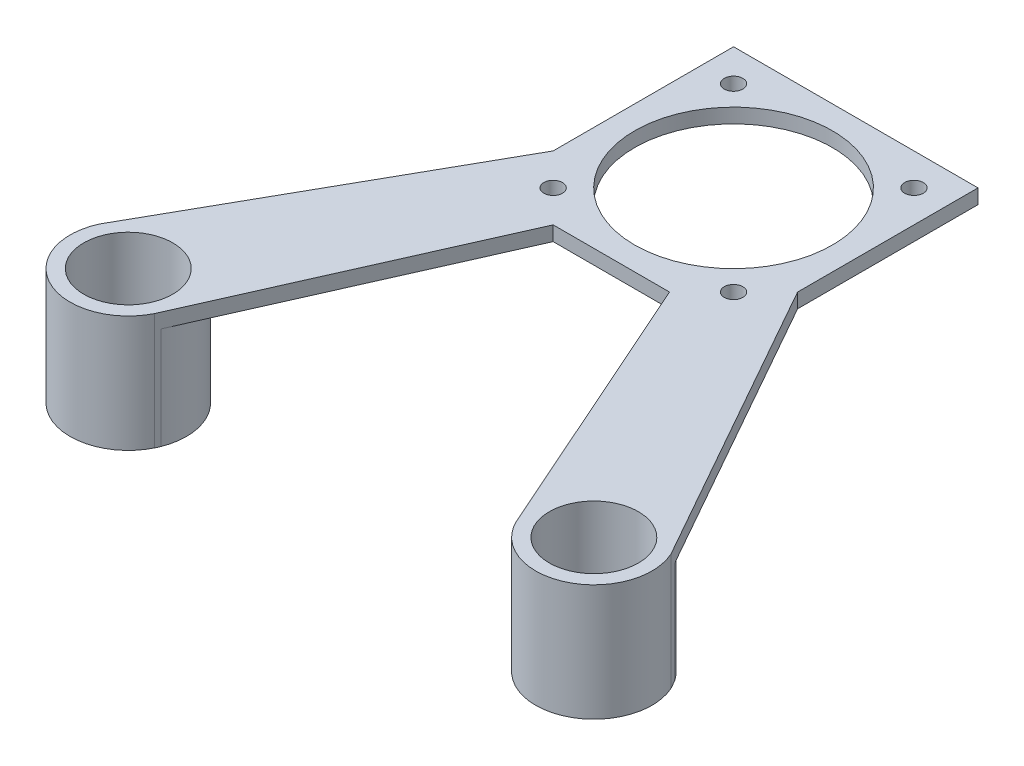
ISO-10303-21;
HEADER;
FILE_DESCRIPTION(('STEP AP214'),'2;1');
FILE_NAME('part.step','',(''),(''),'','','');
FILE_SCHEMA(('AUTOMOTIVE_DESIGN { 1 0 10303 214 1 1 1 1 }'));
ENDSEC;
DATA;
#1=APPLICATION_CONTEXT('core data for automotive mechanical design processes');
#2=APPLICATION_PROTOCOL_DEFINITION('international standard','automotive_design',2000,#1);
#3=PRODUCT_CONTEXT('',#1,'mechanical');
#4=PRODUCT('Part','Part','',(#3));
#5=PRODUCT_RELATED_PRODUCT_CATEGORY('part','',(#4));
#6=PRODUCT_DEFINITION_FORMATION('','',#4);
#7=PRODUCT_DEFINITION_CONTEXT('part definition',#1,'design');
#8=PRODUCT_DEFINITION('design','',#6,#7);
#9=PRODUCT_DEFINITION_SHAPE('','',#8);
#10=(LENGTH_UNIT() NAMED_UNIT(*) SI_UNIT(.MILLI.,.METRE.));
#11=(NAMED_UNIT(*) PLANE_ANGLE_UNIT() SI_UNIT($,.RADIAN.));
#12=(NAMED_UNIT(*) SI_UNIT($,.STERADIAN.) SOLID_ANGLE_UNIT());
#13=UNCERTAINTY_MEASURE_WITH_UNIT(LENGTH_MEASURE(1.E-05),#10,'distance_accuracy_value','');
#14=(GEOMETRIC_REPRESENTATION_CONTEXT(3) GLOBAL_UNCERTAINTY_ASSIGNED_CONTEXT((#13)) GLOBAL_UNIT_ASSIGNED_CONTEXT((#10,
#11,#12)) REPRESENTATION_CONTEXT('',''));
#15=CARTESIAN_POINT('',(0.,0.,0.));
#16=DIRECTION('',(0.,0.,1.));
#17=DIRECTION('',(1.,0.,0.));
#18=AXIS2_PLACEMENT_3D('',#15,#16,#17);
#19=CARTESIAN_POINT('',(-21.,2.5,21.));
#20=DIRECTION('',(0.,0.,-1.));
#21=DIRECTION('',(-1.,0.,0.));
#22=AXIS2_PLACEMENT_3D('',#19,#20,#21);
#23=PLANE('',#22);
#24=DIRECTION('',(0.,1.,0.));
#25=VECTOR('',#24,1.);
#26=CARTESIAN_POINT('',(-10.,0.,21.));
#27=LINE('',#26,#25);
#28=CARTESIAN_POINT('',(-10.,0.,21.));
#29=VERTEX_POINT('',#28);
#30=CARTESIAN_POINT('',(-10.,2.5,21.));
#31=VERTEX_POINT('',#30);
#32=EDGE_CURVE('E214',#29,#31,#27,.T.);
#33=ORIENTED_EDGE('',*,*,#32,.F.);
#34=DIRECTION('',(1.,0.,0.));
#35=VECTOR('',#34,1.);
#36=CARTESIAN_POINT('',(-21.,0.,21.));
#37=LINE('',#36,#35);
#38=CARTESIAN_POINT('',(10.,0.,21.));
#39=VERTEX_POINT('',#38);
#40=EDGE_CURVE('E276',#29,#39,#37,.T.);
#41=ORIENTED_EDGE('',*,*,#40,.T.);
#42=DIRECTION('',(0.,1.,0.));
#43=VECTOR('',#42,1.);
#44=CARTESIAN_POINT('',(10.,0.,21.));
#45=LINE('',#44,#43);
#46=CARTESIAN_POINT('',(10.,2.5,21.));
#47=VERTEX_POINT('',#46);
#48=EDGE_CURVE('E232',#39,#47,#45,.T.);
#49=ORIENTED_EDGE('',*,*,#48,.T.);
#50=DIRECTION('',(1.,0.,0.));
#51=VECTOR('',#50,1.);
#52=CARTESIAN_POINT('',(-21.,2.5,21.));
#53=LINE('',#52,#51);
#54=EDGE_CURVE('E281',#31,#47,#53,.T.);
#55=ORIENTED_EDGE('',*,*,#54,.F.);
#56=EDGE_LOOP('',(#33,#41,#49,#55));
#57=FACE_BOUND('',#56,.T.);
#58=ADVANCED_FACE('F37',(#57),#23,.F.);
#59=CARTESIAN_POINT('',(21.,2.5,21.));
#60=DIRECTION('',(-1.,0.,0.));
#61=DIRECTION('',(0.,0.,1.));
#62=AXIS2_PLACEMENT_3D('',#59,#60,#61);
#63=PLANE('',#62);
#64=DIRECTION('',(0.,1.,0.));
#65=VECTOR('',#64,1.);
#66=CARTESIAN_POINT('',(21.,0.,10.));
#67=LINE('',#66,#65);
#68=CARTESIAN_POINT('',(21.,0.,10.));
#69=VERTEX_POINT('',#68);
#70=CARTESIAN_POINT('',(21.,2.5,10.));
#71=VERTEX_POINT('',#70);
#72=EDGE_CURVE('E236',#69,#71,#67,.T.);
#73=ORIENTED_EDGE('',*,*,#72,.F.);
#74=DIRECTION('',(0.,0.,-1.));
#75=VECTOR('',#74,1.);
#76=CARTESIAN_POINT('',(21.,0.,21.));
#77=LINE('',#76,#75);
#78=CARTESIAN_POINT('',(21.,0.,-21.));
#79=VERTEX_POINT('',#78);
#80=EDGE_CURVE('E270',#69,#79,#77,.T.);
#81=ORIENTED_EDGE('',*,*,#80,.T.);
#82=DIRECTION('',(0.,-1.,0.));
#83=VECTOR('',#82,1.);
#84=CARTESIAN_POINT('',(21.,2.5,-21.));
#85=LINE('',#84,#83);
#86=CARTESIAN_POINT('',(21.,2.5,-21.));
#87=VERTEX_POINT('',#86);
#88=EDGE_CURVE('E11',#87,#79,#85,.T.);
#89=ORIENTED_EDGE('',*,*,#88,.F.);
#90=DIRECTION('',(0.,0.,-1.));
#91=VECTOR('',#90,1.);
#92=CARTESIAN_POINT('',(21.,2.5,21.));
#93=LINE('',#92,#91);
#94=EDGE_CURVE('E273',#71,#87,#93,.T.);
#95=ORIENTED_EDGE('',*,*,#94,.F.);
#96=EDGE_LOOP('',(#73,#81,#89,#95));
#97=FACE_BOUND('',#96,.T.);
#98=ADVANCED_FACE('F39',(#97),#63,.F.);
#99=CARTESIAN_POINT('',(0.,2.5,0.));
#100=DIRECTION('',(0.,-1.,0.));
#101=DIRECTION('',(0.,0.,-1.));
#102=AXIS2_PLACEMENT_3D('',#99,#100,#101);
#103=PLANE('',#102);
#104=DIRECTION('',(-0.491053344533862,0.,0.871129504047537));
#105=VECTOR('',#104,1.);
#106=CARTESIAN_POINT('',(-11.6584883044176,2.5,-6.5718583143991));
#107=LINE('',#106,#105);
#108=CARTESIAN_POINT('',(-21.,2.5,10.));
#109=VERTEX_POINT('',#108);
#110=CARTESIAN_POINT('',(-49.0891902477221,2.5,59.8302733134276));
#111=VERTEX_POINT('',#110);
#112=EDGE_CURVE('E200',#109,#111,#107,.T.);
#113=ORIENTED_EDGE('',*,*,#112,.T.);
#114=CARTESIAN_POINT('',(-40.,2.5,64.));
#115=DIRECTION('',(0.,1.,0.));
#116=DIRECTION('',(0.,0.,1.));
#117=AXIS2_PLACEMENT_3D('',#114,#115,#116);
#118=CIRCLE('',#117,10.);
#119=CARTESIAN_POINT('',(-31.0355106229445,2.5,68.4314704341403));
#120=VERTEX_POINT('',#119);
#121=EDGE_CURVE('E171',#111,#120,#118,.T.);
#122=ORIENTED_EDGE('',*,*,#121,.T.);
#123=DIRECTION('',(-0.405411820128638,0.,0.914134156510949));
#124=VECTOR('',#123,1.);
#125=CARTESIAN_POINT('',(-0.57379592410976,2.5,-0.254474300428293));
#126=LINE('',#125,#124);
#127=EDGE_CURVE('E206',#31,#120,#126,.T.);
#128=ORIENTED_EDGE('',*,*,#127,.F.);
#129=ORIENTED_EDGE('',*,*,#54,.T.);
#130=DIRECTION('',(0.405411820128638,0.,0.914134156510949));
#131=VECTOR('',#130,1.);
#132=CARTESIAN_POINT('',(0.57379592410976,2.5,-0.254474300428293));
#133=LINE('',#132,#131);
#134=CARTESIAN_POINT('',(31.0355106229445,2.5,68.4314704341403));
#135=VERTEX_POINT('',#134);
#136=EDGE_CURVE('E213',#47,#135,#133,.T.);
#137=ORIENTED_EDGE('',*,*,#136,.T.);
#138=CARTESIAN_POINT('',(40.,2.5,64.));
#139=DIRECTION('',(0.,1.,0.));
#140=DIRECTION('',(0.,0.,1.));
#141=AXIS2_PLACEMENT_3D('',#138,#139,#140);
#142=CIRCLE('',#141,10.);
#143=CARTESIAN_POINT('',(49.0891902477221,2.5,59.8302733134276));
#144=VERTEX_POINT('',#143);
#145=EDGE_CURVE('E225',#135,#144,#142,.T.);
#146=ORIENTED_EDGE('',*,*,#145,.T.);
#147=DIRECTION('',(0.491053344533862,0.,0.871129504047538));
#148=VECTOR('',#147,1.);
#149=CARTESIAN_POINT('',(11.6584883044176,2.5,-6.5718583143991));
#150=LINE('',#149,#148);
#151=EDGE_CURVE('E228',#71,#144,#150,.T.);
#152=ORIENTED_EDGE('',*,*,#151,.F.);
#153=ORIENTED_EDGE('',*,*,#94,.T.);
#154=DIRECTION('',(-1.,0.,0.));
#155=VECTOR('',#154,1.);
#156=CARTESIAN_POINT('',(-21.,2.5,-21.));
#157=LINE('',#156,#155);
#158=CARTESIAN_POINT('',(-21.,2.5,-21.));
#159=VERTEX_POINT('',#158);
#160=EDGE_CURVE('E275',#87,#159,#157,.T.);
#161=ORIENTED_EDGE('',*,*,#160,.T.);
#162=DIRECTION('',(0.,0.,1.));
#163=VECTOR('',#162,1.);
#164=CARTESIAN_POINT('',(-21.,2.5,21.));
#165=LINE('',#164,#163);
#166=EDGE_CURVE('E278',#159,#109,#165,.T.);
#167=ORIENTED_EDGE('',*,*,#166,.T.);
#168=EDGE_LOOP('',(#113,#122,#128,#129,#137,#146,#152,#153,#161,#167));
#169=FACE_BOUND('',#168,.T.);
#170=CARTESIAN_POINT('',(15.5,2.5,-15.5));
#171=DIRECTION('',(0.,1.,0.));
#172=DIRECTION('',(0.,0.,1.));
#173=AXIS2_PLACEMENT_3D('',#170,#171,#172);
#174=CIRCLE('',#173,1.6);
#175=CARTESIAN_POINT('',(15.5,2.5,-13.9));
#176=VERTEX_POINT('',#175);
#177=EDGE_CURVE('E267',#176,#176,#174,.T.);
#178=ORIENTED_EDGE('',*,*,#177,.F.);
#179=EDGE_LOOP('',(#178));
#180=FACE_BOUND('',#179,.T.);
#181=CARTESIAN_POINT('',(-15.5,2.5,-15.5));
#182=DIRECTION('',(0.,1.,0.));
#183=DIRECTION('',(0.,0.,1.));
#184=AXIS2_PLACEMENT_3D('',#181,#182,#183);
#185=CIRCLE('',#184,1.6);
#186=CARTESIAN_POINT('',(-15.5,2.5,-13.9));
#187=VERTEX_POINT('',#186);
#188=EDGE_CURVE('E261',#187,#187,#185,.T.);
#189=ORIENTED_EDGE('',*,*,#188,.F.);
#190=EDGE_LOOP('',(#189));
#191=FACE_BOUND('',#190,.T.);
#192=CARTESIAN_POINT('',(-15.5,2.5,15.5));
#193=DIRECTION('',(0.,1.,0.));
#194=DIRECTION('',(0.,0.,1.));
#195=AXIS2_PLACEMENT_3D('',#192,#193,#194);
#196=CIRCLE('',#195,1.6);
#197=CARTESIAN_POINT('',(-15.5,2.5,17.1));
#198=VERTEX_POINT('',#197);
#199=EDGE_CURVE('E255',#198,#198,#196,.T.);
#200=ORIENTED_EDGE('',*,*,#199,.F.);
#201=EDGE_LOOP('',(#200));
#202=FACE_BOUND('',#201,.T.);
#203=CARTESIAN_POINT('',(15.5,2.5,15.5));
#204=DIRECTION('',(0.,1.,0.));
#205=DIRECTION('',(0.,0.,1.));
#206=AXIS2_PLACEMENT_3D('',#203,#204,#205);
#207=CIRCLE('',#206,1.6);
#208=CARTESIAN_POINT('',(15.5,2.5,17.1));
#209=VERTEX_POINT('',#208);
#210=EDGE_CURVE('E249',#209,#209,#207,.T.);
#211=ORIENTED_EDGE('',*,*,#210,.F.);
#212=EDGE_LOOP('',(#211));
#213=FACE_BOUND('',#212,.T.);
#214=CARTESIAN_POINT('',(0.,2.5,0.));
#215=DIRECTION('',(0.,1.,0.));
#216=DIRECTION('',(0.,0.,1.));
#217=AXIS2_PLACEMENT_3D('',#214,#215,#216);
#218=CIRCLE('',#217,17.);
#219=CARTESIAN_POINT('',(0.,2.5,17.));
#220=VERTEX_POINT('',#219);
#221=EDGE_CURVE('E243',#220,#220,#218,.T.);
#222=ORIENTED_EDGE('',*,*,#221,.F.);
#223=EDGE_LOOP('',(#222));
#224=FACE_BOUND('',#223,.T.);
#225=CARTESIAN_POINT('',(40.,2.5,64.));
#226=DIRECTION('',(0.,1.,0.));
#227=DIRECTION('',(0.,0.,1.));
#228=AXIS2_PLACEMENT_3D('',#225,#226,#227);
#229=CIRCLE('',#228,7.65);
#230=CARTESIAN_POINT('',(40.,2.5,71.65));
#231=VERTEX_POINT('',#230);
#232=EDGE_CURVE('E221',#231,#231,#229,.T.);
#233=ORIENTED_EDGE('',*,*,#232,.F.);
#234=EDGE_LOOP('',(#233));
#235=FACE_BOUND('',#234,.T.);
#236=CARTESIAN_POINT('',(-40.,2.5,64.));
#237=DIRECTION('',(0.,1.,0.));
#238=DIRECTION('',(0.,0.,1.));
#239=AXIS2_PLACEMENT_3D('',#236,#237,#238);
#240=CIRCLE('',#239,7.65);
#241=CARTESIAN_POINT('',(-40.,2.5,71.65));
#242=VERTEX_POINT('',#241);
#243=EDGE_CURVE('E202',#242,#242,#240,.T.);
#244=ORIENTED_EDGE('',*,*,#243,.F.);
#245=EDGE_LOOP('',(#244));
#246=FACE_BOUND('',#245,.T.);
#247=ADVANCED_FACE('F310',(#169,#180,#191,#202,#213,#224,#235,#246),#103,.F.);
#248=CARTESIAN_POINT('',(0.,0.,0.));
#249=DIRECTION('',(0.,-1.,0.));
#250=DIRECTION('',(0.,0.,-1.));
#251=AXIS2_PLACEMENT_3D('',#248,#249,#250);
#252=PLANE('',#251);
#253=CARTESIAN_POINT('',(-40.,0.,64.));
#254=DIRECTION('',(0.,-1.,0.));
#255=DIRECTION('',(0.,0.,-1.));
#256=AXIS2_PLACEMENT_3D('',#253,#254,#255);
#257=CIRCLE('',#256,10.);
#258=CARTESIAN_POINT('',(-48.2731525653819,0.,58.3826210177775));
#259=VERTEX_POINT('',#258);
#260=CARTESIAN_POINT('',(-30.6976821430824,0.,67.6697251244299));
#261=VERTEX_POINT('',#260);
#262=EDGE_CURVE('E52',#259,#261,#257,.T.);
#263=ORIENTED_EDGE('',*,*,#262,.F.);
#264=DIRECTION('',(-0.491053344533862,0.,0.871129504047537));
#265=VECTOR('',#264,1.);
#266=CARTESIAN_POINT('',(-11.6584883044176,0.,-6.5718583143991));
#267=LINE('',#266,#265);
#268=CARTESIAN_POINT('',(-21.,0.,10.));
#269=VERTEX_POINT('',#268);
#270=EDGE_CURVE('E176',#269,#259,#267,.T.);
#271=ORIENTED_EDGE('',*,*,#270,.F.);
#272=DIRECTION('',(0.,0.,1.));
#273=VECTOR('',#272,1.);
#274=CARTESIAN_POINT('',(-21.,0.,21.));
#275=LINE('',#274,#273);
#276=CARTESIAN_POINT('',(-21.,0.,-21.));
#277=VERTEX_POINT('',#276);
#278=EDGE_CURVE('E286',#277,#269,#275,.T.);
#279=ORIENTED_EDGE('',*,*,#278,.F.);
#280=DIRECTION('',(-1.,0.,0.));
#281=VECTOR('',#280,1.);
#282=CARTESIAN_POINT('',(-21.,0.,-21.));
#283=LINE('',#282,#281);
#284=EDGE_CURVE('E284',#79,#277,#283,.T.);
#285=ORIENTED_EDGE('',*,*,#284,.F.);
#286=ORIENTED_EDGE('',*,*,#80,.F.);
#287=DIRECTION('',(0.491053344533862,0.,0.871129504047538));
#288=VECTOR('',#287,1.);
#289=CARTESIAN_POINT('',(11.6584883044176,0.,-6.5718583143991));
#290=LINE('',#289,#288);
#291=CARTESIAN_POINT('',(48.2731525653819,0.,58.3826210177775));
#292=VERTEX_POINT('',#291);
#293=EDGE_CURVE('E220',#69,#292,#290,.T.);
#294=ORIENTED_EDGE('',*,*,#293,.T.);
#295=CARTESIAN_POINT('',(40.,0.,64.));
#296=DIRECTION('',(0.,-1.,0.));
#297=DIRECTION('',(0.,0.,-1.));
#298=AXIS2_PLACEMENT_3D('',#295,#296,#297);
#299=CIRCLE('',#298,10.);
#300=CARTESIAN_POINT('',(30.6976821430824,0.,67.66972512443));
#301=VERTEX_POINT('',#300);
#302=EDGE_CURVE('E59',#301,#292,#299,.T.);
#303=ORIENTED_EDGE('',*,*,#302,.F.);
#304=DIRECTION('',(0.405411820128638,0.,0.914134156510949));
#305=VECTOR('',#304,1.);
#306=CARTESIAN_POINT('',(0.57379592410976,0.,-0.254474300428293));
#307=LINE('',#306,#305);
#308=EDGE_CURVE('E218',#39,#301,#307,.T.);
#309=ORIENTED_EDGE('',*,*,#308,.F.);
#310=ORIENTED_EDGE('',*,*,#40,.F.);
#311=DIRECTION('',(-0.405411820128638,0.,0.914134156510949));
#312=VECTOR('',#311,1.);
#313=CARTESIAN_POINT('',(-0.57379592410976,0.,-0.254474300428293));
#314=LINE('',#313,#312);
#315=EDGE_CURVE('E173',#29,#261,#314,.T.);
#316=ORIENTED_EDGE('',*,*,#315,.T.);
#317=EDGE_LOOP('',(#263,#271,#279,#285,#286,#294,#303,#309,#310,#316));
#318=FACE_BOUND('',#317,.T.);
#319=CARTESIAN_POINT('',(15.5,0.,15.5));
#320=DIRECTION('',(0.,1.,0.));
#321=DIRECTION('',(0.,0.,1.));
#322=AXIS2_PLACEMENT_3D('',#319,#320,#321);
#323=CIRCLE('',#322,1.6);
#324=CARTESIAN_POINT('',(15.5,0.,17.1));
#325=VERTEX_POINT('',#324);
#326=EDGE_CURVE('E246',#325,#325,#323,.T.);
#327=ORIENTED_EDGE('',*,*,#326,.T.);
#328=EDGE_LOOP('',(#327));
#329=FACE_BOUND('',#328,.T.);
#330=CARTESIAN_POINT('',(-15.5,0.,-15.5));
#331=DIRECTION('',(0.,1.,0.));
#332=DIRECTION('',(0.,0.,1.));
#333=AXIS2_PLACEMENT_3D('',#330,#331,#332);
#334=CIRCLE('',#333,1.6);
#335=CARTESIAN_POINT('',(-15.5,0.,-13.9));
#336=VERTEX_POINT('',#335);
#337=EDGE_CURVE('E258',#336,#336,#334,.T.);
#338=ORIENTED_EDGE('',*,*,#337,.T.);
#339=EDGE_LOOP('',(#338));
#340=FACE_BOUND('',#339,.T.);
#341=CARTESIAN_POINT('',(15.5,0.,-15.5));
#342=DIRECTION('',(0.,1.,0.));
#343=DIRECTION('',(0.,0.,1.));
#344=AXIS2_PLACEMENT_3D('',#341,#342,#343);
#345=CIRCLE('',#344,1.6);
#346=CARTESIAN_POINT('',(15.5,0.,-13.9));
#347=VERTEX_POINT('',#346);
#348=EDGE_CURVE('E264',#347,#347,#345,.T.);
#349=ORIENTED_EDGE('',*,*,#348,.T.);
#350=EDGE_LOOP('',(#349));
#351=FACE_BOUND('',#350,.T.);
#352=CARTESIAN_POINT('',(-15.5,0.,15.5));
#353=DIRECTION('',(0.,1.,0.));
#354=DIRECTION('',(0.,0.,1.));
#355=AXIS2_PLACEMENT_3D('',#352,#353,#354);
#356=CIRCLE('',#355,1.6);
#357=CARTESIAN_POINT('',(-15.5,0.,17.1));
#358=VERTEX_POINT('',#357);
#359=EDGE_CURVE('E252',#358,#358,#356,.T.);
#360=ORIENTED_EDGE('',*,*,#359,.T.);
#361=EDGE_LOOP('',(#360));
#362=FACE_BOUND('',#361,.T.);
#363=CARTESIAN_POINT('',(0.,0.,0.));
#364=DIRECTION('',(0.,1.,0.));
#365=DIRECTION('',(0.,0.,1.));
#366=AXIS2_PLACEMENT_3D('',#363,#364,#365);
#367=CIRCLE('',#366,17.);
#368=CARTESIAN_POINT('',(0.,0.,17.));
#369=VERTEX_POINT('',#368);
#370=EDGE_CURVE('E235',#369,#369,#367,.T.);
#371=ORIENTED_EDGE('',*,*,#370,.T.);
#372=EDGE_LOOP('',(#371));
#373=FACE_BOUND('',#372,.T.);
#374=ADVANCED_FACE('F298',(#318,#329,#340,#351,#362,#373),#252,.T.);
#375=CARTESIAN_POINT('',(-21.,2.5,-21.));
#376=DIRECTION('',(0.,0.,1.));
#377=DIRECTION('',(1.,0.,0.));
#378=AXIS2_PLACEMENT_3D('',#375,#376,#377);
#379=PLANE('',#378);
#380=ORIENTED_EDGE('',*,*,#284,.T.);
#381=DIRECTION('',(0.,-1.,0.));
#382=VECTOR('',#381,1.);
#383=CARTESIAN_POINT('',(-21.,2.5,-21.));
#384=LINE('',#383,#382);
#385=EDGE_CURVE('E45',#159,#277,#384,.T.);
#386=ORIENTED_EDGE('',*,*,#385,.F.);
#387=ORIENTED_EDGE('',*,*,#160,.F.);
#388=ORIENTED_EDGE('',*,*,#88,.T.);
#389=EDGE_LOOP('',(#380,#386,#387,#388));
#390=FACE_BOUND('',#389,.T.);
#391=ADVANCED_FACE('F302',(#390),#379,.F.);
#392=CARTESIAN_POINT('',(-21.,2.5,21.));
#393=DIRECTION('',(1.,0.,0.));
#394=DIRECTION('',(0.,0.,-1.));
#395=AXIS2_PLACEMENT_3D('',#392,#393,#394);
#396=PLANE('',#395);
#397=ORIENTED_EDGE('',*,*,#278,.T.);
#398=DIRECTION('',(0.,1.,0.));
#399=VECTOR('',#398,1.);
#400=CARTESIAN_POINT('',(-21.,0.,10.));
#401=LINE('',#400,#399);
#402=EDGE_CURVE('E210',#269,#109,#401,.T.);
#403=ORIENTED_EDGE('',*,*,#402,.T.);
#404=ORIENTED_EDGE('',*,*,#166,.F.);
#405=ORIENTED_EDGE('',*,*,#385,.T.);
#406=EDGE_LOOP('',(#397,#403,#404,#405));
#407=FACE_BOUND('',#406,.T.);
#408=ADVANCED_FACE('F294',(#407),#396,.F.);
#409=CARTESIAN_POINT('',(15.5,2.5,-15.5));
#410=DIRECTION('',(0.,-1.,0.));
#411=DIRECTION('',(0.,0.,-1.));
#412=AXIS2_PLACEMENT_3D('',#409,#410,#411);
#413=CYLINDRICAL_SURFACE('',#412,1.6);
#414=ORIENTED_EDGE('',*,*,#177,.T.);
#415=EDGE_LOOP('',(#414));
#416=FACE_BOUND('',#415,.T.);
#417=ORIENTED_EDGE('',*,*,#348,.F.);
#418=EDGE_LOOP('',(#417));
#419=FACE_BOUND('',#418,.T.);
#420=ADVANCED_FACE('F341',(#416,#419),#413,.F.);
#421=CARTESIAN_POINT('',(-15.5,2.5,-15.5));
#422=DIRECTION('',(0.,-1.,0.));
#423=DIRECTION('',(0.,0.,-1.));
#424=AXIS2_PLACEMENT_3D('',#421,#422,#423);
#425=CYLINDRICAL_SURFACE('',#424,1.6);
#426=ORIENTED_EDGE('',*,*,#188,.T.);
#427=EDGE_LOOP('',(#426));
#428=FACE_BOUND('',#427,.T.);
#429=ORIENTED_EDGE('',*,*,#337,.F.);
#430=EDGE_LOOP('',(#429));
#431=FACE_BOUND('',#430,.T.);
#432=ADVANCED_FACE('F354',(#428,#431),#425,.F.);
#433=CARTESIAN_POINT('',(-15.5,2.5,15.5));
#434=DIRECTION('',(0.,-1.,0.));
#435=DIRECTION('',(0.,0.,-1.));
#436=AXIS2_PLACEMENT_3D('',#433,#434,#435);
#437=CYLINDRICAL_SURFACE('',#436,1.6);
#438=ORIENTED_EDGE('',*,*,#199,.T.);
#439=EDGE_LOOP('',(#438));
#440=FACE_BOUND('',#439,.T.);
#441=ORIENTED_EDGE('',*,*,#359,.F.);
#442=EDGE_LOOP('',(#441));
#443=FACE_BOUND('',#442,.T.);
#444=ADVANCED_FACE('F358',(#440,#443),#437,.F.);
#445=CARTESIAN_POINT('',(15.5,2.5,15.5));
#446=DIRECTION('',(0.,-1.,0.));
#447=DIRECTION('',(0.,0.,-1.));
#448=AXIS2_PLACEMENT_3D('',#445,#446,#447);
#449=CYLINDRICAL_SURFACE('',#448,1.6);
#450=ORIENTED_EDGE('',*,*,#210,.T.);
#451=EDGE_LOOP('',(#450));
#452=FACE_BOUND('',#451,.T.);
#453=ORIENTED_EDGE('',*,*,#326,.F.);
#454=EDGE_LOOP('',(#453));
#455=FACE_BOUND('',#454,.T.);
#456=ADVANCED_FACE('F362',(#452,#455),#449,.F.);
#457=CARTESIAN_POINT('',(0.,2.5,0.));
#458=DIRECTION('',(0.,-1.,0.));
#459=DIRECTION('',(0.,0.,-1.));
#460=AXIS2_PLACEMENT_3D('',#457,#458,#459);
#461=CYLINDRICAL_SURFACE('',#460,17.);
#462=ORIENTED_EDGE('',*,*,#221,.T.);
#463=EDGE_LOOP('',(#462));
#464=FACE_BOUND('',#463,.T.);
#465=ORIENTED_EDGE('',*,*,#370,.F.);
#466=EDGE_LOOP('',(#465));
#467=FACE_BOUND('',#466,.T.);
#468=ADVANCED_FACE('F366',(#464,#467),#461,.F.);
#469=CARTESIAN_POINT('',(0.57379592410976,0.,-0.254474300428293));
#470=DIRECTION('',(-0.914134156510949,0.,0.405411820128638));
#471=DIRECTION('',(0.405411820128638,0.,0.914134156510949));
#472=AXIS2_PLACEMENT_3D('',#469,#470,#471);
#473=PLANE('',#472);
#474=ORIENTED_EDGE('',*,*,#308,.T.);
#475=DIRECTION('',(0.,1.,0.));
#476=VECTOR('',#475,1.);
#477=CARTESIAN_POINT('',(30.6976821430824,-17.5,67.6697251244299));
#478=LINE('',#477,#476);
#479=CARTESIAN_POINT('',(30.6976821430824,-17.5,67.6697251244299));
#480=VERTEX_POINT('',#479);
#481=EDGE_CURVE('E193',#480,#301,#478,.T.);
#482=ORIENTED_EDGE('',*,*,#481,.F.);
#483=DIRECTION('',(0.405411820128638,0.,0.914134156510949));
#484=VECTOR('',#483,1.);
#485=CARTESIAN_POINT('',(0.57379592410976,-17.5,-0.254474300428293));
#486=LINE('',#485,#484);
#487=CARTESIAN_POINT('',(31.0355106229445,-17.5,68.4314704341403));
#488=VERTEX_POINT('',#487);
#489=EDGE_CURVE('E189',#480,#488,#486,.T.);
#490=ORIENTED_EDGE('',*,*,#489,.T.);
#491=DIRECTION('',(0.,1.,0.));
#492=VECTOR('',#491,1.);
#493=CARTESIAN_POINT('',(31.0355106229445,0.,68.4314704341403));
#494=LINE('',#493,#492);
#495=EDGE_CURVE('E223',#488,#135,#494,.T.);
#496=ORIENTED_EDGE('',*,*,#495,.T.);
#497=ORIENTED_EDGE('',*,*,#136,.F.);
#498=ORIENTED_EDGE('',*,*,#48,.F.);
#499=EDGE_LOOP('',(#474,#482,#490,#496,#497,#498));
#500=FACE_BOUND('',#499,.T.);
#501=ADVANCED_FACE('F326',(#500),#473,.T.);
#502=CARTESIAN_POINT('',(11.6584883044176,0.,-6.5718583143991));
#503=DIRECTION('',(-0.871129504047538,0.,0.491053344533862));
#504=DIRECTION('',(0.491053344533862,0.,0.871129504047538));
#505=AXIS2_PLACEMENT_3D('',#502,#503,#504);
#506=PLANE('',#505);
#507=ORIENTED_EDGE('',*,*,#151,.T.);
#508=DIRECTION('',(0.,1.,0.));
#509=VECTOR('',#508,1.);
#510=CARTESIAN_POINT('',(49.0891902477221,0.,59.8302733134276));
#511=LINE('',#510,#509);
#512=CARTESIAN_POINT('',(49.0891902477221,-17.5,59.8302733134276));
#513=VERTEX_POINT('',#512);
#514=EDGE_CURVE('E238',#513,#144,#511,.T.);
#515=ORIENTED_EDGE('',*,*,#514,.F.);
#516=DIRECTION('',(0.491053344533862,0.,0.871129504047538));
#517=VECTOR('',#516,1.);
#518=CARTESIAN_POINT('',(11.6584883044176,-17.5,-6.5718583143991));
#519=LINE('',#518,#517);
#520=CARTESIAN_POINT('',(48.2731525653819,-17.5,58.3826210177775));
#521=VERTEX_POINT('',#520);
#522=EDGE_CURVE('E183',#521,#513,#519,.T.);
#523=ORIENTED_EDGE('',*,*,#522,.F.);
#524=DIRECTION('',(0.,1.,0.));
#525=VECTOR('',#524,1.);
#526=CARTESIAN_POINT('',(48.2731525653819,-17.5,58.3826210177775));
#527=LINE('',#526,#525);
#528=EDGE_CURVE('E196',#521,#292,#527,.T.);
#529=ORIENTED_EDGE('',*,*,#528,.T.);
#530=ORIENTED_EDGE('',*,*,#293,.F.);
#531=ORIENTED_EDGE('',*,*,#72,.T.);
#532=EDGE_LOOP('',(#507,#515,#523,#529,#530,#531));
#533=FACE_BOUND('',#532,.T.);
#534=ADVANCED_FACE('F308',(#533),#506,.F.);
#535=CARTESIAN_POINT('',(40.,0.,64.));
#536=DIRECTION('',(0.,1.,0.));
#537=DIRECTION('',(0.,0.,1.));
#538=AXIS2_PLACEMENT_3D('',#535,#536,#537);
#539=CYLINDRICAL_SURFACE('',#538,10.);
#540=ORIENTED_EDGE('',*,*,#145,.F.);
#541=ORIENTED_EDGE('',*,*,#495,.F.);
#542=CARTESIAN_POINT('',(40.,-17.5,64.));
#543=DIRECTION('',(0.,1.,0.));
#544=DIRECTION('',(0.,0.,1.));
#545=AXIS2_PLACEMENT_3D('',#542,#543,#544);
#546=CIRCLE('',#545,10.);
#547=EDGE_CURVE('E190',#488,#513,#546,.T.);
#548=ORIENTED_EDGE('',*,*,#547,.T.);
#549=ORIENTED_EDGE('',*,*,#514,.T.);
#550=EDGE_LOOP('',(#540,#541,#548,#549));
#551=FACE_BOUND('',#550,.T.);
#552=ADVANCED_FACE('F315',(#551),#539,.T.);
#553=CARTESIAN_POINT('',(40.,0.,64.));
#554=DIRECTION('',(0.,1.,0.));
#555=DIRECTION('',(0.,0.,1.));
#556=AXIS2_PLACEMENT_3D('',#553,#554,#555);
#557=CYLINDRICAL_SURFACE('',#556,7.65);
#558=ORIENTED_EDGE('',*,*,#232,.T.);
#559=EDGE_LOOP('',(#558));
#560=FACE_BOUND('',#559,.T.);
#561=CARTESIAN_POINT('',(40.,-17.5,64.));
#562=DIRECTION('',(0.,1.,0.));
#563=DIRECTION('',(0.,0.,1.));
#564=AXIS2_PLACEMENT_3D('',#561,#562,#563);
#565=CIRCLE('',#564,7.65);
#566=CARTESIAN_POINT('',(40.,-17.5,71.65));
#567=VERTEX_POINT('',#566);
#568=EDGE_CURVE('E178',#567,#567,#565,.T.);
#569=ORIENTED_EDGE('',*,*,#568,.F.);
#570=EDGE_LOOP('',(#569));
#571=FACE_BOUND('',#570,.T.);
#572=ADVANCED_FACE('F375',(#560,#571),#557,.F.);
#573=CARTESIAN_POINT('',(-11.6584883044176,0.,-6.5718583143991));
#574=DIRECTION('',(-0.871129504047537,0.,-0.491053344533862));
#575=DIRECTION('',(-0.491053344533862,0.,0.871129504047537));
#576=AXIS2_PLACEMENT_3D('',#573,#574,#575);
#577=PLANE('',#576);
#578=ORIENTED_EDGE('',*,*,#270,.T.);
#579=DIRECTION('',(0.,1.,0.));
#580=VECTOR('',#579,1.);
#581=CARTESIAN_POINT('',(-48.2731525653819,-17.5,58.3826210177775));
#582=LINE('',#581,#580);
#583=CARTESIAN_POINT('',(-48.2731525653819,-17.5,58.3826210177775));
#584=VERTEX_POINT('',#583);
#585=EDGE_CURVE('E146',#584,#259,#582,.T.);
#586=ORIENTED_EDGE('',*,*,#585,.F.);
#587=DIRECTION('',(-0.491053344533862,0.,0.871129504047537));
#588=VECTOR('',#587,1.);
#589=CARTESIAN_POINT('',(-11.6584883044176,-17.5,-6.5718583143991));
#590=LINE('',#589,#588);
#591=CARTESIAN_POINT('',(-49.0891902477221,-17.5,59.8302733134276));
#592=VERTEX_POINT('',#591);
#593=EDGE_CURVE('E162',#584,#592,#590,.T.);
#594=ORIENTED_EDGE('',*,*,#593,.T.);
#595=DIRECTION('',(0.,1.,0.));
#596=VECTOR('',#595,1.);
#597=CARTESIAN_POINT('',(-49.0891902477221,0.,59.8302733134276));
#598=LINE('',#597,#596);
#599=EDGE_CURVE('E170',#592,#111,#598,.T.);
#600=ORIENTED_EDGE('',*,*,#599,.T.);
#601=ORIENTED_EDGE('',*,*,#112,.F.);
#602=ORIENTED_EDGE('',*,*,#402,.F.);
#603=EDGE_LOOP('',(#578,#586,#594,#600,#601,#602));
#604=FACE_BOUND('',#603,.T.);
#605=ADVANCED_FACE('F175',(#604),#577,.T.);
#606=CARTESIAN_POINT('',(-0.57379592410976,0.,-0.254474300428293));
#607=DIRECTION('',(-0.914134156510949,0.,-0.405411820128638));
#608=DIRECTION('',(-0.405411820128638,0.,0.914134156510949));
#609=AXIS2_PLACEMENT_3D('',#606,#607,#608);
#610=PLANE('',#609);
#611=ORIENTED_EDGE('',*,*,#127,.T.);
#612=DIRECTION('',(0.,1.,0.));
#613=VECTOR('',#612,1.);
#614=CARTESIAN_POINT('',(-31.0355106229445,0.,68.4314704341403));
#615=LINE('',#614,#613);
#616=CARTESIAN_POINT('',(-31.0355106229445,-17.5,68.4314704341403));
#617=VERTEX_POINT('',#616);
#618=EDGE_CURVE('E153',#617,#120,#615,.T.);
#619=ORIENTED_EDGE('',*,*,#618,.F.);
#620=DIRECTION('',(-0.405411820128638,0.,0.914134156510949));
#621=VECTOR('',#620,1.);
#622=CARTESIAN_POINT('',(-0.57379592410976,-17.5,-0.254474300428293));
#623=LINE('',#622,#621);
#624=CARTESIAN_POINT('',(-30.6976821430824,-17.5,67.6697251244299));
#625=VERTEX_POINT('',#624);
#626=EDGE_CURVE('E150',#625,#617,#623,.T.);
#627=ORIENTED_EDGE('',*,*,#626,.F.);
#628=DIRECTION('',(0.,1.,0.));
#629=VECTOR('',#628,1.);
#630=CARTESIAN_POINT('',(-30.6976821430824,-17.5,67.6697251244299));
#631=LINE('',#630,#629);
#632=EDGE_CURVE('E139',#625,#261,#631,.T.);
#633=ORIENTED_EDGE('',*,*,#632,.T.);
#634=ORIENTED_EDGE('',*,*,#315,.F.);
#635=ORIENTED_EDGE('',*,*,#32,.T.);
#636=EDGE_LOOP('',(#611,#619,#627,#633,#634,#635));
#637=FACE_BOUND('',#636,.T.);
#638=ADVANCED_FACE('F151',(#637),#610,.F.);
#639=CARTESIAN_POINT('',(-40.,0.,64.));
#640=DIRECTION('',(0.,1.,0.));
#641=DIRECTION('',(0.,0.,1.));
#642=AXIS2_PLACEMENT_3D('',#639,#640,#641);
#643=CYLINDRICAL_SURFACE('',#642,10.);
#644=ORIENTED_EDGE('',*,*,#121,.F.);
#645=ORIENTED_EDGE('',*,*,#599,.F.);
#646=CARTESIAN_POINT('',(-40.,-17.5,64.));
#647=DIRECTION('',(0.,1.,0.));
#648=DIRECTION('',(0.,0.,1.));
#649=AXIS2_PLACEMENT_3D('',#646,#647,#648);
#650=CIRCLE('',#649,10.);
#651=EDGE_CURVE('E147',#592,#617,#650,.T.);
#652=ORIENTED_EDGE('',*,*,#651,.T.);
#653=ORIENTED_EDGE('',*,*,#618,.T.);
#654=EDGE_LOOP('',(#644,#645,#652,#653));
#655=FACE_BOUND('',#654,.T.);
#656=ADVANCED_FACE('F167',(#655),#643,.T.);
#657=CARTESIAN_POINT('',(-40.,0.,64.));
#658=DIRECTION('',(0.,1.,0.));
#659=DIRECTION('',(0.,0.,1.));
#660=AXIS2_PLACEMENT_3D('',#657,#658,#659);
#661=CYLINDRICAL_SURFACE('',#660,7.65);
#662=ORIENTED_EDGE('',*,*,#243,.T.);
#663=EDGE_LOOP('',(#662));
#664=FACE_BOUND('',#663,.T.);
#665=CARTESIAN_POINT('',(-40.,-17.5,64.));
#666=DIRECTION('',(0.,1.,0.));
#667=DIRECTION('',(0.,0.,1.));
#668=AXIS2_PLACEMENT_3D('',#665,#666,#667);
#669=CIRCLE('',#668,7.65);
#670=CARTESIAN_POINT('',(-40.,-17.5,71.65));
#671=VERTEX_POINT('',#670);
#672=EDGE_CURVE('E157',#671,#671,#669,.T.);
#673=ORIENTED_EDGE('',*,*,#672,.F.);
#674=EDGE_LOOP('',(#673));
#675=FACE_BOUND('',#674,.T.);
#676=ADVANCED_FACE('F385',(#664,#675),#661,.F.);
#677=CARTESIAN_POINT('',(40.,-17.5,64.));
#678=DIRECTION('',(0.,1.,0.));
#679=DIRECTION('',(0.,0.,1.));
#680=AXIS2_PLACEMENT_3D('',#677,#678,#679);
#681=CYLINDRICAL_SURFACE('',#680,10.);
#682=ORIENTED_EDGE('',*,*,#481,.T.);
#683=ORIENTED_EDGE('',*,*,#302,.T.);
#684=ORIENTED_EDGE('',*,*,#528,.F.);
#685=EDGE_CURVE('E186',#521,#480,#546,.T.);
#686=ORIENTED_EDGE('',*,*,#685,.T.);
#687=EDGE_LOOP('',(#682,#683,#684,#686));
#688=FACE_BOUND('',#687,.T.);
#689=ADVANCED_FACE('F324',(#688),#681,.T.);
#690=CARTESIAN_POINT('',(0.,-17.5,0.));
#691=DIRECTION('',(0.,1.,0.));
#692=DIRECTION('',(0.,0.,1.));
#693=AXIS2_PLACEMENT_3D('',#690,#691,#692);
#694=PLANE('',#693);
#695=ORIENTED_EDGE('',*,*,#568,.T.);
#696=EDGE_LOOP('',(#695));
#697=FACE_BOUND('',#696,.T.);
#698=ORIENTED_EDGE('',*,*,#522,.T.);
#699=ORIENTED_EDGE('',*,*,#547,.F.);
#700=ORIENTED_EDGE('',*,*,#489,.F.);
#701=ORIENTED_EDGE('',*,*,#685,.F.);
#702=EDGE_LOOP('',(#698,#699,#700,#701));
#703=FACE_BOUND('',#702,.T.);
#704=ADVANCED_FACE('F321',(#697,#703),#694,.F.);
#705=CARTESIAN_POINT('',(-40.,-17.5,64.));
#706=DIRECTION('',(0.,1.,0.));
#707=DIRECTION('',(0.,0.,1.));
#708=AXIS2_PLACEMENT_3D('',#705,#706,#707);
#709=CYLINDRICAL_SURFACE('',#708,10.);
#710=ORIENTED_EDGE('',*,*,#585,.T.);
#711=ORIENTED_EDGE('',*,*,#262,.T.);
#712=ORIENTED_EDGE('',*,*,#632,.F.);
#713=EDGE_CURVE('E144',#625,#584,#650,.T.);
#714=ORIENTED_EDGE('',*,*,#713,.T.);
#715=EDGE_LOOP('',(#710,#711,#712,#714));
#716=FACE_BOUND('',#715,.T.);
#717=ADVANCED_FACE('F142',(#716),#709,.T.);
#718=CARTESIAN_POINT('',(0.,-17.5,0.));
#719=DIRECTION('',(0.,1.,0.));
#720=DIRECTION('',(0.,0.,1.));
#721=AXIS2_PLACEMENT_3D('',#718,#719,#720);
#722=PLANE('',#721);
#723=ORIENTED_EDGE('',*,*,#672,.T.);
#724=EDGE_LOOP('',(#723));
#725=FACE_BOUND('',#724,.T.);
#726=ORIENTED_EDGE('',*,*,#626,.T.);
#727=ORIENTED_EDGE('',*,*,#651,.F.);
#728=ORIENTED_EDGE('',*,*,#593,.F.);
#729=ORIENTED_EDGE('',*,*,#713,.F.);
#730=EDGE_LOOP('',(#726,#727,#728,#729));
#731=FACE_BOUND('',#730,.T.);
#732=ADVANCED_FACE('F160',(#725,#731),#722,.F.);
#733=CLOSED_SHELL('',(#58,#98,#247,#374,#391,#408,#420,#432,#444,#456,#468,#501,#534,#552,#572,
#605,#638,#656,#676,#689,#704,#717,#732));
#734=MANIFOLD_SOLID_BREP('B2',#733);
#735=ADVANCED_BREP_SHAPE_REPRESENTATION('',(#18,#734),#14);
#736=SHAPE_DEFINITION_REPRESENTATION(#9,#735);
ENDSEC;
END-ISO-10303-21;
